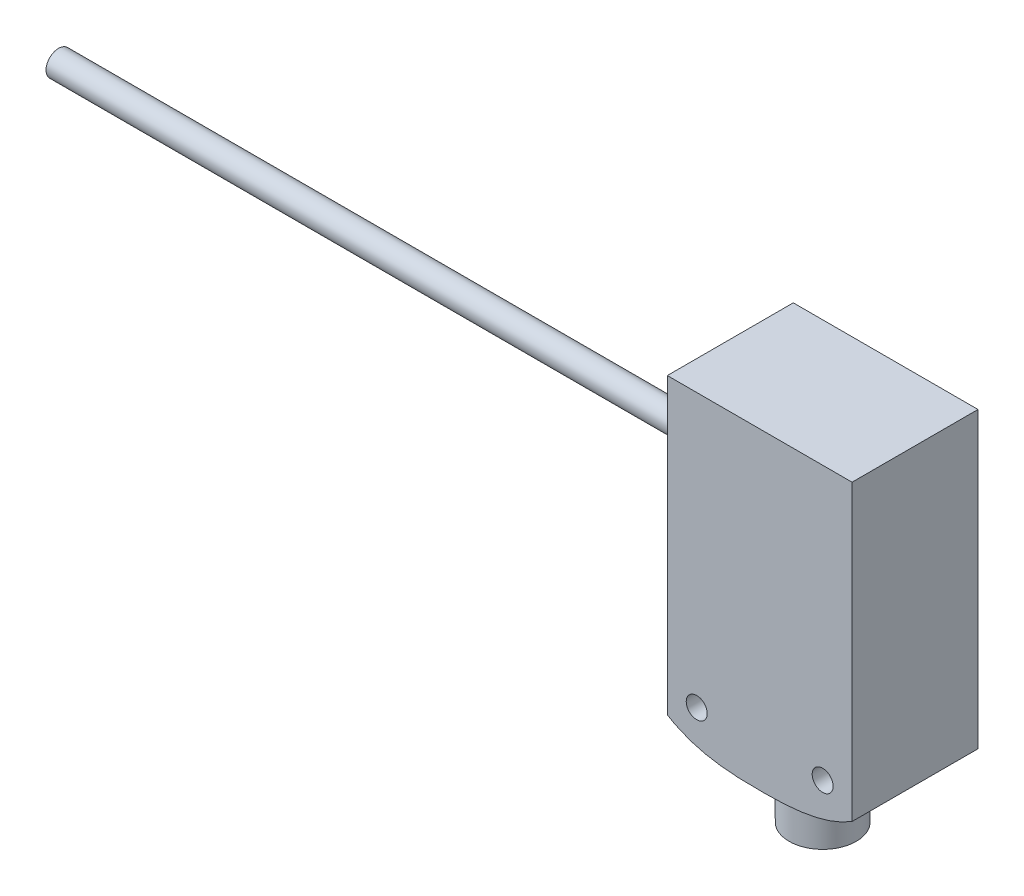
ISO-10303-21;
HEADER;
FILE_DESCRIPTION(('STEP AP214'),'2;1');
FILE_NAME('part.step','',(''),(''),'','','');
FILE_SCHEMA(('AUTOMOTIVE_DESIGN { 1 0 10303 214 1 1 1 1 }'));
ENDSEC;
DATA;
#1=APPLICATION_CONTEXT('core data for automotive mechanical design processes');
#2=APPLICATION_PROTOCOL_DEFINITION('international standard','automotive_design',2000,#1);
#3=PRODUCT_CONTEXT('',#1,'mechanical');
#4=PRODUCT('Part','Part','',(#3));
#5=PRODUCT_RELATED_PRODUCT_CATEGORY('part','',(#4));
#6=PRODUCT_DEFINITION_FORMATION('','',#4);
#7=PRODUCT_DEFINITION_CONTEXT('part definition',#1,'design');
#8=PRODUCT_DEFINITION('design','',#6,#7);
#9=PRODUCT_DEFINITION_SHAPE('','',#8);
#10=(LENGTH_UNIT() NAMED_UNIT(*) SI_UNIT(.MILLI.,.METRE.));
#11=(NAMED_UNIT(*) PLANE_ANGLE_UNIT() SI_UNIT($,.RADIAN.));
#12=(NAMED_UNIT(*) SI_UNIT($,.STERADIAN.) SOLID_ANGLE_UNIT());
#13=UNCERTAINTY_MEASURE_WITH_UNIT(LENGTH_MEASURE(1.E-05),#10,'distance_accuracy_value','');
#14=(GEOMETRIC_REPRESENTATION_CONTEXT(3) GLOBAL_UNCERTAINTY_ASSIGNED_CONTEXT((#13)) GLOBAL_UNIT_ASSIGNED_CONTEXT((#10,
#11,#12)) REPRESENTATION_CONTEXT('',''));
#15=CARTESIAN_POINT('',(0.,0.,0.));
#16=DIRECTION('',(0.,0.,1.));
#17=DIRECTION('',(1.,0.,0.));
#18=AXIS2_PLACEMENT_3D('',#15,#16,#17);
#19=CARTESIAN_POINT('',(-91.,32.8,7.5));
#20=DIRECTION('',(1.,0.,0.));
#21=DIRECTION('',(0.,0.,-1.));
#22=AXIS2_PLACEMENT_3D('',#19,#20,#21);
#23=CYLINDRICAL_SURFACE('',#22,1.5);
#24=CARTESIAN_POINT('',(-91.,32.8,7.5));
#25=DIRECTION('',(-1.,0.,0.));
#26=DIRECTION('',(0.,0.,1.));
#27=AXIS2_PLACEMENT_3D('',#24,#25,#26);
#28=CIRCLE('',#27,1.5);
#29=CARTESIAN_POINT('',(-91.,32.8,9.));
#30=VERTEX_POINT('',#29);
#31=EDGE_CURVE('E11',#30,#30,#28,.T.);
#32=ORIENTED_EDGE('',*,*,#31,.F.);
#33=EDGE_LOOP('',(#32));
#34=FACE_BOUND('',#33,.T.);
#35=CARTESIAN_POINT('',(-11.,32.8,7.5));
#36=DIRECTION('',(-1.,0.,0.));
#37=DIRECTION('',(0.,0.,1.));
#38=AXIS2_PLACEMENT_3D('',#35,#36,#37);
#39=CIRCLE('',#38,1.5);
#40=CARTESIAN_POINT('',(-11.,32.8,9.));
#41=VERTEX_POINT('',#40);
#42=EDGE_CURVE('E52',#41,#41,#39,.T.);
#43=ORIENTED_EDGE('',*,*,#42,.T.);
#44=EDGE_LOOP('',(#43));
#45=FACE_BOUND('',#44,.T.);
#46=ADVANCED_FACE('F49',(#34,#45),#23,.T.);
#47=CARTESIAN_POINT('',(-91.,32.8,7.5));
#48=DIRECTION('',(-1.,0.,0.));
#49=DIRECTION('',(0.,0.,1.));
#50=AXIS2_PLACEMENT_3D('',#47,#48,#49);
#51=PLANE('',#50);
#52=ORIENTED_EDGE('',*,*,#31,.T.);
#53=EDGE_LOOP('',(#52));
#54=FACE_BOUND('',#53,.T.);
#55=ADVANCED_FACE('F64',(#54),#51,.T.);
#56=CARTESIAN_POINT('',(-11.,32.8,7.5));
#57=DIRECTION('',(-1.,0.,0.));
#58=DIRECTION('',(0.,0.,1.));
#59=AXIS2_PLACEMENT_3D('',#56,#57,#58);
#60=PLANE('',#59);
#61=ORIENTED_EDGE('',*,*,#42,.F.);
#62=EDGE_LOOP('',(#61));
#63=FACE_BOUND('',#62,.T.);
#64=ADVANCED_FACE('F62',(#63),#60,.F.);
#65=CLOSED_SHELL('',(#46,#55,#64));
#66=MANIFOLD_SOLID_BREP('B2',#65);
#67=CARTESIAN_POINT('',(11.,9.3,0.));
#68=CARTESIAN_POINT('',(7.62537457172211,7.23673007694766,0.));
#69=CARTESIAN_POINT('',(0.,6.76326992305233,0.));
#70=CARTESIAN_POINT('',(-7.62537457172212,7.23673007694767,0.));
#71=CARTESIAN_POINT('',(-11.,9.3,0.));
#72=B_SPLINE_CURVE_WITH_KNOTS('',3,(#67,#68,#69,#70,#71),.UNSPECIFIED.,.F.,.F.,(4,1,4),(0.,0.5,
1.),.UNSPECIFIED.);
#73=DIRECTION('',(0.,0.,1.));
#74=VECTOR('',#73,1.);
#75=SURFACE_OF_LINEAR_EXTRUSION('',#72,#74);
#76=CARTESIAN_POINT('',(11.,9.3,15.));
#77=CARTESIAN_POINT('',(7.62537457172211,7.23673007694766,15.));
#78=CARTESIAN_POINT('',(0.,6.76326992305233,15.));
#79=CARTESIAN_POINT('',(-7.62537457172212,7.23673007694767,15.));
#80=CARTESIAN_POINT('',(-11.,9.3,15.));
#81=B_SPLINE_CURVE_WITH_KNOTS('',3,(#76,#77,#78,#79,#80),.UNSPECIFIED.,.F.,.F.,(4,1,4),(0.,0.5,
1.),.UNSPECIFIED.);
#82=CARTESIAN_POINT('',(11.,9.3,15.));
#83=VERTEX_POINT('',#82);
#84=CARTESIAN_POINT('',(-11.,9.3,15.));
#85=VERTEX_POINT('',#84);
#86=EDGE_CURVE('E122',#83,#85,#81,.T.);
#87=ORIENTED_EDGE('',*,*,#86,.T.);
#88=DIRECTION('',(0.,0.,1.));
#89=VECTOR('',#88,1.);
#90=CARTESIAN_POINT('',(-11.,9.3,0.));
#91=LINE('',#90,#89);
#92=CARTESIAN_POINT('',(-11.,9.3,0.));
#93=VERTEX_POINT('',#92);
#94=EDGE_CURVE('E211',#93,#85,#91,.T.);
#95=ORIENTED_EDGE('',*,*,#94,.F.);
#96=CARTESIAN_POINT('',(11.,9.3,0.));
#97=VERTEX_POINT('',#96);
#98=EDGE_CURVE('E205',#97,#93,#72,.T.);
#99=ORIENTED_EDGE('',*,*,#98,.F.);
#100=DIRECTION('',(0.,0.,1.));
#101=VECTOR('',#100,1.);
#102=CARTESIAN_POINT('',(11.,9.3,0.));
#103=LINE('',#102,#101);
#104=EDGE_CURVE('E292',#97,#83,#103,.T.);
#105=ORIENTED_EDGE('',*,*,#104,.T.);
#106=EDGE_LOOP('',(#87,#95,#99,#105));
#107=FACE_BOUND('',#106,.T.);
#108=CARTESIAN_POINT('',(0.,7.0000000000025,3.5));
#109=CARTESIAN_POINT('',(0.22439439935221,7.00000125301037,3.50000968765886));
#110=CARTESIAN_POINT('',(0.448941548053714,7.00083032711492,3.51894492720915));
#111=CARTESIAN_POINT('',(0.891836619614709,7.00469064216585,3.59421070501428));
#112=CARTESIAN_POINT('',(1.1101773529625,7.00772433691042,3.65058290551943));
#113=CARTESIAN_POINT('',(1.53419118893364,7.01619340560287,3.79909822405339));
#114=CARTESIAN_POINT('',(1.73987011840827,7.0216276652749,3.89122474350967));
#115=CARTESIAN_POINT('',(2.13277455188842,7.03464465181378,4.10858788356927));
#116=CARTESIAN_POINT('',(2.32000405926751,7.04222691119244,4.23381729929993));
#117=CARTESIAN_POINT('',(2.67093026662562,7.0588316517902,4.51393713770192));
#118=CARTESIAN_POINT('',(2.83460942713917,7.06785519598146,4.66884946899593));
#119=CARTESIAN_POINT('',(3.1336860014841,7.08624554735671,5.00391394182719));
#120=CARTESIAN_POINT('',(3.2690818212955,7.09561237385279,5.18406750497883));
#121=CARTESIAN_POINT('',(3.50804333172789,7.11341492256552,5.5649826127234));
#122=CARTESIAN_POINT('',(3.61153753175449,7.12184852675559,5.76578911714154));
#123=CARTESIAN_POINT('',(3.78332915841526,7.13649328392245,6.18200731252531));
#124=CARTESIAN_POINT('',(3.8516274551061,7.14270449183659,6.39741864230489));
#125=CARTESIAN_POINT('',(3.95094921563395,7.15191460960394,6.8362865058816));
#126=CARTESIAN_POINT('',(3.98204681856726,7.15491990737435,7.05972612069069));
#127=CARTESIAN_POINT('',(4.00630212930006,7.15725422466925,7.50867095156947));
#128=CARTESIAN_POINT('',(3.9994608596348,7.15658334327479,7.73417611180468));
#129=CARTESIAN_POINT('',(3.94814007204997,7.15168420569334,8.17995742511222));
#130=CARTESIAN_POINT('',(3.90380207147854,7.14746932534535,8.40025004185015));
#131=CARTESIAN_POINT('',(3.77895946361968,7.13617137316259,8.83026003320635));
#132=CARTESIAN_POINT('',(3.69845402501207,7.12908823540039,9.03997716462045));
#133=CARTESIAN_POINT('',(3.50337611853196,7.11312735717629,9.4433607158157));
#134=CARTESIAN_POINT('',(3.38873576309751,7.10424605188845,9.636994157503));
#135=CARTESIAN_POINT('',(3.12867708961996,7.08599077533882,10.0023301151966));
#136=CARTESIAN_POINT('',(2.98325818697742,7.07661679472183,10.1740322145455));
#137=CARTESIAN_POINT('',(2.66512868247824,7.05858666461076,10.4912768195617));
#138=CARTESIAN_POINT('',(2.49232028814389,7.04993326353616,10.6367214348943));
#139=CARTESIAN_POINT('',(2.12466316535358,7.03436825781713,10.8965368479663));
#140=CARTESIAN_POINT('',(1.92981482043195,7.02745662286963,11.0109081863183));
#141=CARTESIAN_POINT('',(1.52387172408515,7.01594501286417,11.2051883520305));
#142=CARTESIAN_POINT('',(1.31279551986721,7.0113424427169,11.285135852925));
#143=CARTESIAN_POINT('',(0.880059989222229,7.00452184208543,11.4084578922122));
#144=CARTESIAN_POINT('',(0.658400579974256,7.00230383026526,11.4518321443444));
#145=CARTESIAN_POINT('',(0.323236978926082,7.00051989291401,11.4885055729031));
#146=CARTESIAN_POINT('',(0.211122994039906,7.00018222531189,11.4960018386167));
#147=CARTESIAN_POINT('',(-0.0133389219275425,6.99992600531257,11.5015528789716));
#148=CARTESIAN_POINT('',(-0.12568685280814,7.00000745255602,11.4996076617082));
#149=CARTESIAN_POINT('',(-0.461845227837278,7.00094838404738,11.4795708849745));
#150=CARTESIAN_POINT('',(-0.684973670513185,7.00250335075343,11.4473002631626));
#151=CARTESIAN_POINT('',(-1.1225790417887,7.00793849795555,11.345821911616));
#152=CARTESIAN_POINT('',(-1.33705369436406,7.01181928596328,11.2766045317912));
#153=CARTESIAN_POINT('',(-1.7513468318626,7.02194588311564,11.1032181076615));
#154=CARTESIAN_POINT('',(-1.95116534848986,7.0281916871441,10.9990491389665));
#155=CARTESIAN_POINT('',(-2.3304512962829,7.04263131874652,10.7587433191008));
#156=CARTESIAN_POINT('',(-2.50991954721105,7.05082506781091,10.6226077563077));
#157=CARTESIAN_POINT('',(-2.84348916390995,7.06829726575762,10.3222232061028));
#158=CARTESIAN_POINT('',(-2.99758982669802,7.07757574468761,10.1579734398518));
#159=CARTESIAN_POINT('',(-3.27642756171496,7.09605308974232,9.80556421856531));
#160=CARTESIAN_POINT('',(-3.40109521253919,7.10525171931236,9.61734981667922));
#161=CARTESIAN_POINT('',(-3.61707554700771,7.1222304166689,9.22260841094127));
#162=CARTESIAN_POINT('',(-3.70838853523951,7.13001049740895,9.01608157433598));
#163=CARTESIAN_POINT('',(-3.85502441061273,7.14295876816829,8.5905991914311));
#164=CARTESIAN_POINT('',(-3.91035632365379,7.14812761314683,8.3716467770995));
#165=CARTESIAN_POINT('',(-3.9834511941488,7.15503100551879,7.92750789887446));
#166=CARTESIAN_POINT('',(-4.00121537258515,7.15676566452598,7.70232163782716));
#167=CARTESIAN_POINT('',(-3.99866055369119,7.15651932659909,7.25311340602665));
#168=CARTESIAN_POINT('',(-3.97850055916513,7.15455384304398,7.02909050546339));
#169=CARTESIAN_POINT('',(-3.90100026312252,7.14725524940516,6.58762832586644));
#170=CARTESIAN_POINT('',(-3.84365956498467,7.14192210339727,6.3701891170895));
#171=CARTESIAN_POINT('',(-3.69346018327395,7.12873130883833,5.94805289599994));
#172=CARTESIAN_POINT('',(-3.60060444556894,7.12087386967861,5.74335482848419));
#173=CARTESIAN_POINT('',(-3.38201248723207,7.10382373893622,5.35240891204786));
#174=CARTESIAN_POINT('',(-3.25627658212902,7.09463106016732,5.16616088609832));
#175=CARTESIAN_POINT('',(-2.97487023447592,7.07617091787339,4.81658785543776));
#176=CARTESIAN_POINT('',(-2.8190797314892,7.06690330225173,4.65335949440853));
#177=CARTESIAN_POINT('',(-2.48223152004462,7.04950926519354,4.35530517753812));
#178=CARTESIAN_POINT('',(-2.30116811073027,7.04138310206867,4.22048564719783));
#179=CARTESIAN_POINT('',(-1.91876631928339,7.0271150189966,3.98303338976419));
#180=CARTESIAN_POINT('',(-1.71741021338652,7.02097485367991,3.88042912721317));
#181=CARTESIAN_POINT('',(-1.30041846346927,7.01109150954002,3.71060938927216));
#182=CARTESIAN_POINT('',(-1.08479936310078,7.00734560559905,3.64335369614758));
#183=CARTESIAN_POINT('',(-0.72326324519807,7.00307866185629,3.56324013931602));
#184=CARTESIAN_POINT('',(-0.57966043865072,7.00188566200386,3.53955626817374));
#185=CARTESIAN_POINT('',(-0.290726470393572,7.00034592296466,3.50793301956921));
#186=CARTESIAN_POINT('',(-0.145395299815608,6.99999918812192,3.49999372292683));
#187=CARTESIAN_POINT('',(0.,7.0000000000025,3.5));
#188=B_SPLINE_CURVE_WITH_KNOTS('',3,(#108,#109,#110,#111,#112,#113,#114,#115,#116,#117,#118,
#119,#120,#121,#122,#123,#124,#125,#126,#127,#128,#129,#130,#131,#132,#133,#134,#135,#136,#137,
#138,#139,#140,#141,#142,#143,#144,#145,#146,#147,#148,#149,#150,#151,#152,#153,#154,#155,#156,
#157,#158,#159,#160,#161,#162,#163,#164,#165,#166,#167,#168,#169,#170,#171,#172,#173,#174,#175,
#176,#177,#178,#179,#180,#181,#182,#183,#184,#185,#186,#187),.UNSPECIFIED.,.T.,.F.,(4,2,2,2,2,2,
2,2,2,2,2,2,2,2,2,2,2,2,2,2,2,2,2,2,2,2,2,2,2,2,2,2,2,2,2,2,2,2,2,4),(0.,0.672653279328891,
1.34605638757915,2.01914724863845,2.69209173136937,3.36553483348842,4.03901587993393,
4.7139953856385,5.38895820478188,6.06257360420852,6.73617084832115,7.40723713943914,
8.07831885602041,8.75074423800014,9.42318239299291,10.0980778985217,10.7729616614747,
11.4470852339066,12.1212140826888,12.4579642312003,12.794714090973,13.4676077797968,
14.1406773071703,14.81374537852,15.4867863272735,16.1598459240947,16.8344775005462,
17.5091029162553,18.1835590359498,18.8579932349266,19.5296060674845,20.2012260645206,
20.8727903647343,21.5443482206343,22.2186465105323,22.8930971497007,23.5681420490864,
24.2424172463255,24.6782575501707,25.1141000912604),.UNSPECIFIED.);
#189=CARTESIAN_POINT('',(0.,7.0000000000025,3.5));
#190=VERTEX_POINT('',#189);
#191=EDGE_CURVE('E47',#190,#190,#188,.T.);
#192=ORIENTED_EDGE('',*,*,#191,.F.);
#193=EDGE_LOOP('',(#192));
#194=FACE_BOUND('',#193,.T.);
#195=ADVANCED_FACE('F95',(#107,#194),#75,.F.);
#196=CARTESIAN_POINT('',(0.,0.,15.));
#197=DIRECTION('',(0.,0.,1.));
#198=DIRECTION('',(1.,0.,0.));
#199=AXIS2_PLACEMENT_3D('',#196,#197,#198);
#200=PLANE('',#199);
#201=ORIENTED_EDGE('',*,*,#86,.F.);
#202=DIRECTION('',(0.,1.,0.));
#203=VECTOR('',#202,1.);
#204=CARTESIAN_POINT('',(11.,0.,15.));
#205=LINE('',#204,#203);
#206=CARTESIAN_POINT('',(11.,44.3,15.));
#207=VERTEX_POINT('',#206);
#208=EDGE_CURVE('E274',#83,#207,#205,.T.);
#209=ORIENTED_EDGE('',*,*,#208,.T.);
#210=DIRECTION('',(-1.,0.,0.));
#211=VECTOR('',#210,1.);
#212=CARTESIAN_POINT('',(11.,44.3,15.));
#213=LINE('',#212,#211);
#214=CARTESIAN_POINT('',(-11.,44.3,15.));
#215=VERTEX_POINT('',#214);
#216=EDGE_CURVE('E276',#207,#215,#213,.T.);
#217=ORIENTED_EDGE('',*,*,#216,.T.);
#218=DIRECTION('',(0.,-1.,0.));
#219=VECTOR('',#218,1.);
#220=CARTESIAN_POINT('',(-11.,0.,15.));
#221=LINE('',#220,#219);
#222=EDGE_CURVE('E271',#215,#85,#221,.T.);
#223=ORIENTED_EDGE('',*,*,#222,.T.);
#224=EDGE_LOOP('',(#201,#209,#217,#223));
#225=FACE_BOUND('',#224,.T.);
#226=CARTESIAN_POINT('',(7.5,11.8,15.));
#227=DIRECTION('',(0.,0.,1.));
#228=DIRECTION('',(1.,0.,0.));
#229=AXIS2_PLACEMENT_3D('',#226,#227,#228);
#230=CIRCLE('',#229,1.25);
#231=CARTESIAN_POINT('',(8.75,11.8,15.));
#232=VERTEX_POINT('',#231);
#233=EDGE_CURVE('E280',#232,#232,#230,.T.);
#234=ORIENTED_EDGE('',*,*,#233,.F.);
#235=EDGE_LOOP('',(#234));
#236=FACE_BOUND('',#235,.T.);
#237=CARTESIAN_POINT('',(-7.5,11.8,15.));
#238=DIRECTION('',(0.,0.,1.));
#239=DIRECTION('',(-1.,0.,0.));
#240=AXIS2_PLACEMENT_3D('',#237,#238,#239);
#241=CIRCLE('',#240,1.25);
#242=CARTESIAN_POINT('',(-8.75,11.8,15.));
#243=VERTEX_POINT('',#242);
#244=EDGE_CURVE('E286',#243,#243,#241,.T.);
#245=ORIENTED_EDGE('',*,*,#244,.F.);
#246=EDGE_LOOP('',(#245));
#247=FACE_BOUND('',#246,.T.);
#248=ADVANCED_FACE('F221',(#225,#236,#247),#200,.T.);
#249=CARTESIAN_POINT('',(0.,0.,0.));
#250=DIRECTION('',(0.,0.,1.));
#251=DIRECTION('',(1.,0.,0.));
#252=AXIS2_PLACEMENT_3D('',#249,#250,#251);
#253=PLANE('',#252);
#254=CARTESIAN_POINT('',(7.5,11.8,0.));
#255=DIRECTION('',(0.,0.,1.));
#256=DIRECTION('',(1.,0.,0.));
#257=AXIS2_PLACEMENT_3D('',#254,#255,#256);
#258=CIRCLE('',#257,1.25);
#259=CARTESIAN_POINT('',(8.75,11.8,0.));
#260=VERTEX_POINT('',#259);
#261=EDGE_CURVE('E283',#260,#260,#258,.T.);
#262=ORIENTED_EDGE('',*,*,#261,.T.);
#263=EDGE_LOOP('',(#262));
#264=FACE_BOUND('',#263,.T.);
#265=DIRECTION('',(0.,1.,0.));
#266=VECTOR('',#265,1.);
#267=CARTESIAN_POINT('',(11.,0.,0.));
#268=LINE('',#267,#266);
#269=CARTESIAN_POINT('',(11.,44.3,0.));
#270=VERTEX_POINT('',#269);
#271=EDGE_CURVE('E266',#97,#270,#268,.T.);
#272=ORIENTED_EDGE('',*,*,#271,.F.);
#273=ORIENTED_EDGE('',*,*,#98,.T.);
#274=DIRECTION('',(0.,-1.,0.));
#275=VECTOR('',#274,1.);
#276=CARTESIAN_POINT('',(-11.,0.,0.));
#277=LINE('',#276,#275);
#278=CARTESIAN_POINT('',(-11.,44.3,0.));
#279=VERTEX_POINT('',#278);
#280=EDGE_CURVE('E265',#279,#93,#277,.T.);
#281=ORIENTED_EDGE('',*,*,#280,.F.);
#282=DIRECTION('',(-1.,0.,0.));
#283=VECTOR('',#282,1.);
#284=CARTESIAN_POINT('',(11.,44.3,0.));
#285=LINE('',#284,#283);
#286=EDGE_CURVE('E256',#270,#279,#285,.T.);
#287=ORIENTED_EDGE('',*,*,#286,.F.);
#288=EDGE_LOOP('',(#272,#273,#281,#287));
#289=FACE_BOUND('',#288,.T.);
#290=CARTESIAN_POINT('',(-7.5,11.8,0.));
#291=DIRECTION('',(0.,0.,1.));
#292=DIRECTION('',(-1.,0.,0.));
#293=AXIS2_PLACEMENT_3D('',#290,#291,#292);
#294=CIRCLE('',#293,1.25);
#295=CARTESIAN_POINT('',(-8.75,11.8,0.));
#296=VERTEX_POINT('',#295);
#297=EDGE_CURVE('E289',#296,#296,#294,.T.);
#298=ORIENTED_EDGE('',*,*,#297,.T.);
#299=EDGE_LOOP('',(#298));
#300=FACE_BOUND('',#299,.T.);
#301=ADVANCED_FACE('F237',(#264,#289,#300),#253,.F.);
#302=CARTESIAN_POINT('',(11.,0.,15.));
#303=DIRECTION('',(-1.,0.,0.));
#304=DIRECTION('',(0.,0.,1.));
#305=AXIS2_PLACEMENT_3D('',#302,#303,#304);
#306=PLANE('',#305);
#307=ORIENTED_EDGE('',*,*,#208,.F.);
#308=ORIENTED_EDGE('',*,*,#104,.F.);
#309=ORIENTED_EDGE('',*,*,#271,.T.);
#310=DIRECTION('',(0.,0.,-1.));
#311=VECTOR('',#310,1.);
#312=CARTESIAN_POINT('',(11.,44.3,15.));
#313=LINE('',#312,#311);
#314=EDGE_CURVE('E107',#207,#270,#313,.T.);
#315=ORIENTED_EDGE('',*,*,#314,.F.);
#316=EDGE_LOOP('',(#307,#308,#309,#315));
#317=FACE_BOUND('',#316,.T.);
#318=ADVANCED_FACE('F97',(#317),#306,.F.);
#319=CARTESIAN_POINT('',(11.,44.3,15.));
#320=DIRECTION('',(0.,-1.,0.));
#321=DIRECTION('',(0.,0.,-1.));
#322=AXIS2_PLACEMENT_3D('',#319,#320,#321);
#323=PLANE('',#322);
#324=ORIENTED_EDGE('',*,*,#286,.T.);
#325=DIRECTION('',(0.,0.,-1.));
#326=VECTOR('',#325,1.);
#327=CARTESIAN_POINT('',(-11.,44.3,15.));
#328=LINE('',#327,#326);
#329=EDGE_CURVE('E259',#215,#279,#328,.T.);
#330=ORIENTED_EDGE('',*,*,#329,.F.);
#331=ORIENTED_EDGE('',*,*,#216,.F.);
#332=ORIENTED_EDGE('',*,*,#314,.T.);
#333=EDGE_LOOP('',(#324,#330,#331,#332));
#334=FACE_BOUND('',#333,.T.);
#335=ADVANCED_FACE('F243',(#334),#323,.F.);
#336=CARTESIAN_POINT('',(-11.,0.,15.));
#337=DIRECTION('',(1.,0.,0.));
#338=DIRECTION('',(0.,0.,-1.));
#339=AXIS2_PLACEMENT_3D('',#336,#337,#338);
#340=PLANE('',#339);
#341=DIRECTION('',(0.,0.,-1.));
#342=VECTOR('',#341,1.);
#343=CARTESIAN_POINT('',(-11.,37.8,1.3));
#344=LINE('',#343,#342);
#345=CARTESIAN_POINT('',(-11.,37.8,13.7));
#346=VERTEX_POINT('',#345);
#347=CARTESIAN_POINT('',(-11.,37.8,1.3));
#348=VERTEX_POINT('',#347);
#349=EDGE_CURVE('E193',#346,#348,#344,.T.);
#350=ORIENTED_EDGE('',*,*,#349,.F.);
#351=DIRECTION('',(0.,1.,0.));
#352=VECTOR('',#351,1.);
#353=CARTESIAN_POINT('',(-11.,37.8,13.7));
#354=LINE('',#353,#352);
#355=CARTESIAN_POINT('',(-11.,16.8,13.7));
#356=VERTEX_POINT('',#355);
#357=EDGE_CURVE('E114',#356,#346,#354,.T.);
#358=ORIENTED_EDGE('',*,*,#357,.F.);
#359=CARTESIAN_POINT('',(-11.,35.8147311314149,7.5));
#360=DIRECTION('',(-1.,0.,0.));
#361=DIRECTION('',(0.,0.,1.));
#362=AXIS2_PLACEMENT_3D('',#359,#360,#361);
#363=CIRCLE('',#362,20.);
#364=CARTESIAN_POINT('',(-11.,16.8,1.3));
#365=VERTEX_POINT('',#364);
#366=EDGE_CURVE('E184',#365,#356,#363,.T.);
#367=ORIENTED_EDGE('',*,*,#366,.F.);
#368=DIRECTION('',(0.,-1.,0.));
#369=VECTOR('',#368,1.);
#370=CARTESIAN_POINT('',(-11.,37.8,1.3));
#371=LINE('',#370,#369);
#372=EDGE_CURVE('E187',#348,#365,#371,.T.);
#373=ORIENTED_EDGE('',*,*,#372,.F.);
#374=EDGE_LOOP('',(#350,#358,#367,#373));
#375=FACE_BOUND('',#374,.T.);
#376=ORIENTED_EDGE('',*,*,#280,.T.);
#377=ORIENTED_EDGE('',*,*,#94,.T.);
#378=ORIENTED_EDGE('',*,*,#222,.F.);
#379=ORIENTED_EDGE('',*,*,#329,.T.);
#380=EDGE_LOOP('',(#376,#377,#378,#379));
#381=FACE_BOUND('',#380,.T.);
#382=ADVANCED_FACE('F233',(#375,#381),#340,.F.);
#383=CARTESIAN_POINT('',(7.5,11.8,15.));
#384=DIRECTION('',(0.,0.,-1.));
#385=DIRECTION('',(-1.,0.,0.));
#386=AXIS2_PLACEMENT_3D('',#383,#384,#385);
#387=CYLINDRICAL_SURFACE('',#386,1.25);
#388=ORIENTED_EDGE('',*,*,#233,.T.);
#389=EDGE_LOOP('',(#388));
#390=FACE_BOUND('',#389,.T.);
#391=ORIENTED_EDGE('',*,*,#261,.F.);
#392=EDGE_LOOP('',(#391));
#393=FACE_BOUND('',#392,.T.);
#394=ADVANCED_FACE('F229',(#390,#393),#387,.F.);
#395=CARTESIAN_POINT('',(-7.5,11.8,15.));
#396=DIRECTION('',(0.,0.,-1.));
#397=DIRECTION('',(-1.,0.,0.));
#398=AXIS2_PLACEMENT_3D('',#395,#396,#397);
#399=CYLINDRICAL_SURFACE('',#398,1.25);
#400=ORIENTED_EDGE('',*,*,#244,.T.);
#401=EDGE_LOOP('',(#400));
#402=FACE_BOUND('',#401,.T.);
#403=ORIENTED_EDGE('',*,*,#297,.F.);
#404=EDGE_LOOP('',(#403));
#405=FACE_BOUND('',#404,.T.);
#406=ADVANCED_FACE('F225',(#402,#405),#399,.F.);
#407=CARTESIAN_POINT('',(0.,0.,7.5));
#408=DIRECTION('',(0.,1.,0.));
#409=DIRECTION('',(0.,0.,1.));
#410=AXIS2_PLACEMENT_3D('',#407,#408,#409);
#411=PLANE('',#410);
#412=CARTESIAN_POINT('',(0.,0.,7.5));
#413=DIRECTION('',(0.,1.,0.));
#414=DIRECTION('',(0.,0.,1.));
#415=AXIS2_PLACEMENT_3D('',#412,#413,#414);
#416=CIRCLE('',#415,4.);
#417=CARTESIAN_POINT('',(0.,0.,11.5));
#418=VERTEX_POINT('',#417);
#419=EDGE_CURVE('E199',#418,#418,#416,.T.);
#420=ORIENTED_EDGE('',*,*,#419,.F.);
#421=EDGE_LOOP('',(#420));
#422=FACE_BOUND('',#421,.T.);
#423=ADVANCED_FACE('F228',(#422),#411,.F.);
#424=CARTESIAN_POINT('',(0.,500000.,7.5));
#425=DIRECTION('',(0.,-1.,0.));
#426=DIRECTION('',(0.,0.,-1.));
#427=AXIS2_PLACEMENT_3D('',#424,#425,#426);
#428=CYLINDRICAL_SURFACE('',#427,4.);
#429=ORIENTED_EDGE('',*,*,#419,.T.);
#430=EDGE_LOOP('',(#429));
#431=FACE_BOUND('',#430,.T.);
#432=ORIENTED_EDGE('',*,*,#191,.T.);
#433=EDGE_LOOP('',(#432));
#434=FACE_BOUND('',#433,.T.);
#435=ADVANCED_FACE('F222',(#431,#434),#428,.T.);
#436=CARTESIAN_POINT('',(-10.9,37.8,13.7));
#437=DIRECTION('',(0.,0.,1.));
#438=DIRECTION('',(0.,-1.,0.));
#439=AXIS2_PLACEMENT_3D('',#436,#437,#438);
#440=PLANE('',#439);
#441=ORIENTED_EDGE('',*,*,#357,.T.);
#442=DIRECTION('',(-1.,0.,0.));
#443=VECTOR('',#442,1.);
#444=CARTESIAN_POINT('',(-10.9,37.8,13.7));
#445=LINE('',#444,#443);
#446=CARTESIAN_POINT('',(-10.9,37.8,13.7));
#447=VERTEX_POINT('',#446);
#448=EDGE_CURVE('E162',#447,#346,#445,.T.);
#449=ORIENTED_EDGE('',*,*,#448,.F.);
#450=DIRECTION('',(0.,1.,0.));
#451=VECTOR('',#450,1.);
#452=CARTESIAN_POINT('',(-10.9,37.8,13.7));
#453=LINE('',#452,#451);
#454=CARTESIAN_POINT('',(-10.9,16.8,13.7));
#455=VERTEX_POINT('',#454);
#456=EDGE_CURVE('E166',#455,#447,#453,.T.);
#457=ORIENTED_EDGE('',*,*,#456,.F.);
#458=DIRECTION('',(-1.,0.,0.));
#459=VECTOR('',#458,1.);
#460=CARTESIAN_POINT('',(-10.9,16.8,13.7));
#461=LINE('',#460,#459);
#462=EDGE_CURVE('E197',#455,#356,#461,.T.);
#463=ORIENTED_EDGE('',*,*,#462,.T.);
#464=EDGE_LOOP('',(#441,#449,#457,#463));
#465=FACE_BOUND('',#464,.T.);
#466=ADVANCED_FACE('F164',(#465),#440,.F.);
#467=CARTESIAN_POINT('',(-10.9,35.8147311314149,7.5));
#468=DIRECTION('',(-1.,0.,0.));
#469=DIRECTION('',(0.,0.,1.));
#470=AXIS2_PLACEMENT_3D('',#467,#468,#469);
#471=CYLINDRICAL_SURFACE('',#470,20.);
#472=ORIENTED_EDGE('',*,*,#366,.T.);
#473=ORIENTED_EDGE('',*,*,#462,.F.);
#474=CARTESIAN_POINT('',(-10.9,35.8147311314149,7.5));
#475=DIRECTION('',(-1.,0.,0.));
#476=DIRECTION('',(0.,0.,1.));
#477=AXIS2_PLACEMENT_3D('',#474,#475,#476);
#478=CIRCLE('',#477,20.);
#479=CARTESIAN_POINT('',(-10.9,16.8,1.3));
#480=VERTEX_POINT('',#479);
#481=EDGE_CURVE('E172',#480,#455,#478,.T.);
#482=ORIENTED_EDGE('',*,*,#481,.F.);
#483=DIRECTION('',(-1.,0.,0.));
#484=VECTOR('',#483,1.);
#485=CARTESIAN_POINT('',(-10.9,16.8,1.3));
#486=LINE('',#485,#484);
#487=EDGE_CURVE('E200',#480,#365,#486,.T.);
#488=ORIENTED_EDGE('',*,*,#487,.T.);
#489=EDGE_LOOP('',(#472,#473,#482,#488));
#490=FACE_BOUND('',#489,.T.);
#491=ADVANCED_FACE('F314',(#490),#471,.F.);
#492=CARTESIAN_POINT('',(-10.9,37.8,1.3));
#493=DIRECTION('',(0.,0.,-1.));
#494=DIRECTION('',(0.,1.,0.));
#495=AXIS2_PLACEMENT_3D('',#492,#493,#494);
#496=PLANE('',#495);
#497=ORIENTED_EDGE('',*,*,#372,.T.);
#498=ORIENTED_EDGE('',*,*,#487,.F.);
#499=DIRECTION('',(0.,-1.,0.));
#500=VECTOR('',#499,1.);
#501=CARTESIAN_POINT('',(-10.9,37.8,1.3));
#502=LINE('',#501,#500);
#503=CARTESIAN_POINT('',(-10.9,37.8,1.3));
#504=VERTEX_POINT('',#503);
#505=EDGE_CURVE('E180',#504,#480,#502,.T.);
#506=ORIENTED_EDGE('',*,*,#505,.F.);
#507=DIRECTION('',(-1.,0.,0.));
#508=VECTOR('',#507,1.);
#509=CARTESIAN_POINT('',(-10.9,37.8,1.3));
#510=LINE('',#509,#508);
#511=EDGE_CURVE('E171',#504,#348,#510,.T.);
#512=ORIENTED_EDGE('',*,*,#511,.T.);
#513=EDGE_LOOP('',(#497,#498,#506,#512));
#514=FACE_BOUND('',#513,.T.);
#515=ADVANCED_FACE('F324',(#514),#496,.F.);
#516=CARTESIAN_POINT('',(-10.9,37.8,1.3));
#517=DIRECTION('',(0.,1.,0.));
#518=DIRECTION('',(0.,0.,1.));
#519=AXIS2_PLACEMENT_3D('',#516,#517,#518);
#520=PLANE('',#519);
#521=ORIENTED_EDGE('',*,*,#349,.T.);
#522=ORIENTED_EDGE('',*,*,#511,.F.);
#523=DIRECTION('',(0.,0.,-1.));
#524=VECTOR('',#523,1.);
#525=CARTESIAN_POINT('',(-10.9,37.8,1.3));
#526=LINE('',#525,#524);
#527=EDGE_CURVE('E175',#447,#504,#526,.T.);
#528=ORIENTED_EDGE('',*,*,#527,.F.);
#529=ORIENTED_EDGE('',*,*,#448,.T.);
#530=EDGE_LOOP('',(#521,#522,#528,#529));
#531=FACE_BOUND('',#530,.T.);
#532=ADVANCED_FACE('F176',(#531),#520,.F.);
#533=CARTESIAN_POINT('',(-10.9,35.8147311314149,7.5));
#534=DIRECTION('',(-1.,0.,0.));
#535=DIRECTION('',(0.,0.,1.));
#536=AXIS2_PLACEMENT_3D('',#533,#534,#535);
#537=PLANE('',#536);
#538=ORIENTED_EDGE('',*,*,#456,.T.);
#539=ORIENTED_EDGE('',*,*,#527,.T.);
#540=ORIENTED_EDGE('',*,*,#505,.T.);
#541=ORIENTED_EDGE('',*,*,#481,.T.);
#542=EDGE_LOOP('',(#538,#539,#540,#541));
#543=FACE_BOUND('',#542,.T.);
#544=ADVANCED_FACE('F182',(#543),#537,.T.);
#545=CLOSED_SHELL('',(#195,#248,#301,#318,#335,#382,#394,#406,#423,#435,#466,#491,#515,#532,#544));
#546=MANIFOLD_SOLID_BREP('B6',#545);
#547=ADVANCED_BREP_SHAPE_REPRESENTATION('',(#18,#66,#546),#14);
#548=SHAPE_DEFINITION_REPRESENTATION(#9,#547);
ENDSEC;
END-ISO-10303-21;
